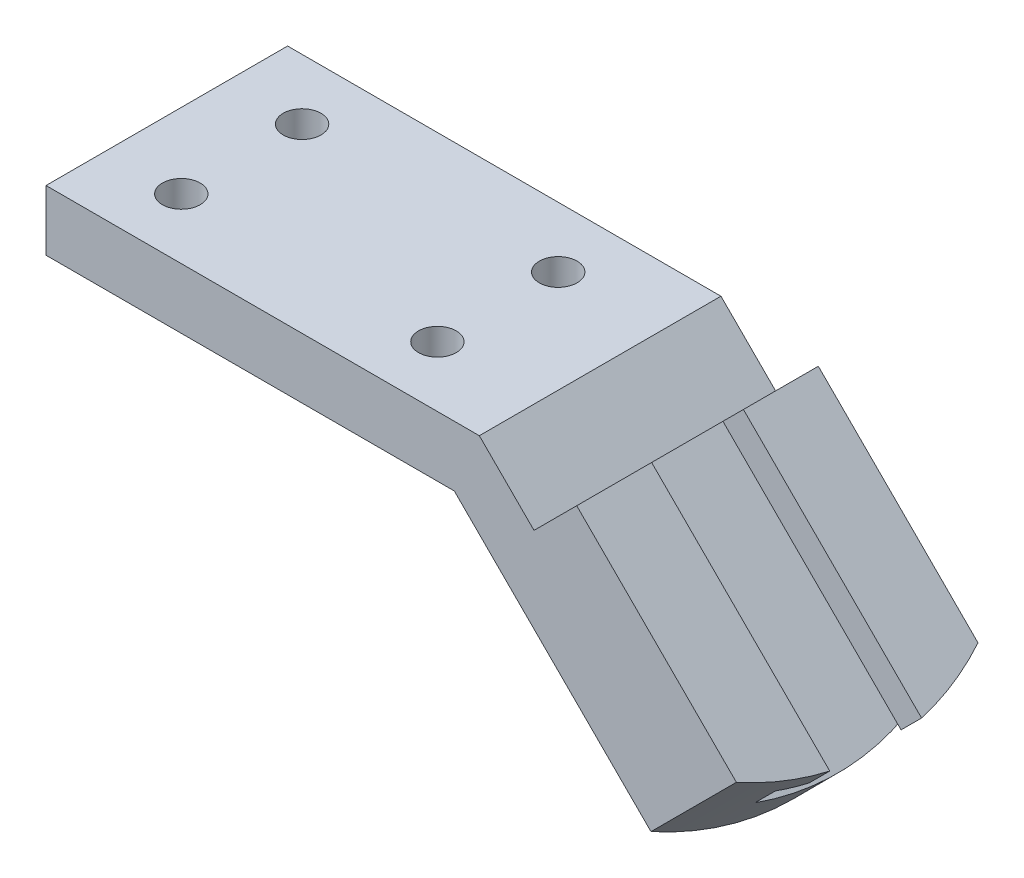
ISO-10303-21;
HEADER;
FILE_DESCRIPTION(('STEP AP214'),'2;1');
FILE_NAME('part.step','',(''),(''),'','','');
FILE_SCHEMA(('AUTOMOTIVE_DESIGN { 1 0 10303 214 1 1 1 1 }'));
ENDSEC;
DATA;
#1=APPLICATION_CONTEXT('core data for automotive mechanical design processes');
#2=APPLICATION_PROTOCOL_DEFINITION('international standard','automotive_design',2000,#1);
#3=PRODUCT_CONTEXT('',#1,'mechanical');
#4=PRODUCT('Part','Part','',(#3));
#5=PRODUCT_RELATED_PRODUCT_CATEGORY('part','',(#4));
#6=PRODUCT_DEFINITION_FORMATION('','',#4);
#7=PRODUCT_DEFINITION_CONTEXT('part definition',#1,'design');
#8=PRODUCT_DEFINITION('design','',#6,#7);
#9=PRODUCT_DEFINITION_SHAPE('','',#8);
#10=(LENGTH_UNIT() NAMED_UNIT(*) SI_UNIT(.MILLI.,.METRE.));
#11=(NAMED_UNIT(*) PLANE_ANGLE_UNIT() SI_UNIT($,.RADIAN.));
#12=(NAMED_UNIT(*) SI_UNIT($,.STERADIAN.) SOLID_ANGLE_UNIT());
#13=UNCERTAINTY_MEASURE_WITH_UNIT(LENGTH_MEASURE(1.E-05),#10,'distance_accuracy_value','');
#14=(GEOMETRIC_REPRESENTATION_CONTEXT(3) GLOBAL_UNCERTAINTY_ASSIGNED_CONTEXT((#13)) GLOBAL_UNIT_ASSIGNED_CONTEXT((#10,
#11,#12)) REPRESENTATION_CONTEXT('',''));
#15=CARTESIAN_POINT('',(0.,0.,0.));
#16=DIRECTION('',(0.,0.,1.));
#17=DIRECTION('',(1.,0.,0.));
#18=AXIS2_PLACEMENT_3D('',#15,#16,#17);
#19=CARTESIAN_POINT('',(85.852,0.,25.4));
#20=DIRECTION('',(0.707106781186543,0.707106781186552,0.));
#21=DIRECTION('',(-0.707106781186552,0.707106781186543,0.));
#22=AXIS2_PLACEMENT_3D('',#19,#20,#21);
#23=PLANE('',#22);
#24=DIRECTION('',(0.707106781186552,-0.707106781186543,0.));
#25=VECTOR('',#24,1.);
#26=CARTESIAN_POINT('',(85.852,0.,-25.4));
#27=LINE('',#26,#25);
#28=CARTESIAN_POINT('',(85.852,0.,-25.4));
#29=VERTEX_POINT('',#28);
#30=CARTESIAN_POINT('',(127.201134012294,-41.3491340122936,-25.4));
#31=VERTEX_POINT('',#30);
#32=EDGE_CURVE('E149',#29,#31,#27,.T.);
#33=ORIENTED_EDGE('',*,*,#32,.T.);
#34=CARTESIAN_POINT('',(93.6269839560378,-7.77498395603773,0.));
#35=DIRECTION('',(0.707106781186543,0.707106781186552,0.));
#36=DIRECTION('',(-0.707106781186552,0.707106781186543,0.));
#37=AXIS2_PLACEMENT_3D('',#34,#35,#36);
#38=CIRCLE('',#37,53.8479999999999);
#39=CARTESIAN_POINT('',(127.201134012294,-41.3491340122936,25.4));
#40=VERTEX_POINT('',#39);
#41=EDGE_CURVE('E215',#31,#40,#38,.F.);
#42=ORIENTED_EDGE('',*,*,#41,.T.);
#43=DIRECTION('',(0.707106781186552,-0.707106781186543,0.));
#44=VECTOR('',#43,1.);
#45=CARTESIAN_POINT('',(85.852,0.,25.4));
#46=LINE('',#45,#44);
#47=CARTESIAN_POINT('',(85.852,0.,25.4));
#48=VERTEX_POINT('',#47);
#49=EDGE_CURVE('E249',#48,#40,#46,.T.);
#50=ORIENTED_EDGE('',*,*,#49,.F.);
#51=DIRECTION('',(0.,0.,-1.));
#52=VECTOR('',#51,1.);
#53=CARTESIAN_POINT('',(85.852,0.,25.4));
#54=LINE('',#53,#52);
#55=EDGE_CURVE('E163',#48,#29,#54,.T.);
#56=ORIENTED_EDGE('',*,*,#55,.T.);
#57=EDGE_LOOP('',(#33,#42,#50,#56));
#58=FACE_BOUND('',#57,.T.);
#59=ADVANCED_FACE('F51',(#58),#23,.F.);
#60=CARTESIAN_POINT('',(0.,0.,-25.4));
#61=DIRECTION('',(0.,0.,1.));
#62=DIRECTION('',(1.,0.,0.));
#63=AXIS2_PLACEMENT_3D('',#60,#61,#62);
#64=PLANE('',#63);
#65=DIRECTION('',(0.707106781186544,0.707106781186551,0.));
#66=VECTOR('',#65,1.);
#67=CARTESIAN_POINT('',(136.540600378206,-32.0096676463819,-25.4));
#68=LINE('',#67,#66);
#69=CARTESIAN_POINT('',(145.161646254432,-23.3886217701554,-25.4));
#70=VERTEX_POINT('',#69);
#71=EDGE_CURVE('E147',#31,#70,#68,.T.);
#72=ORIENTED_EDGE('',*,*,#71,.F.);
#73=ORIENTED_EDGE('',*,*,#32,.F.);
#74=DIRECTION('',(1.,0.,0.));
#75=VECTOR('',#74,1.);
#76=CARTESIAN_POINT('',(0.,0.,-25.4));
#77=LINE('',#76,#75);
#78=CARTESIAN_POINT('',(0.,0.,-25.4));
#79=VERTEX_POINT('',#78);
#80=EDGE_CURVE('E146',#79,#29,#77,.T.);
#81=ORIENTED_EDGE('',*,*,#80,.F.);
#82=DIRECTION('',(0.,-1.,0.));
#83=VECTOR('',#82,1.);
#84=CARTESIAN_POINT('',(0.,12.7,-25.4));
#85=LINE('',#84,#83);
#86=CARTESIAN_POINT('',(0.,12.7,-25.4));
#87=VERTEX_POINT('',#86);
#88=EDGE_CURVE('E143',#87,#79,#85,.T.);
#89=ORIENTED_EDGE('',*,*,#88,.F.);
#90=DIRECTION('',(-1.,0.,0.));
#91=VECTOR('',#90,1.);
#92=CARTESIAN_POINT('',(91.1125122421383,12.7,-25.4));
#93=LINE('',#92,#91);
#94=CARTESIAN_POINT('',(91.1125122421383,12.7,-25.4));
#95=VERTEX_POINT('',#94);
#96=EDGE_CURVE('E98',#95,#87,#93,.T.);
#97=ORIENTED_EDGE('',*,*,#96,.F.);
#98=DIRECTION('',(-0.707106781186534,0.707106781186561,0.));
#99=VECTOR('',#98,1.);
#100=CARTESIAN_POINT('',(102.607240077107,1.20527216503115,-25.4));
#101=LINE('',#100,#99);
#102=CARTESIAN_POINT('',(102.607240077107,1.20527216503115,-25.4));
#103=VERTEX_POINT('',#102);
#104=EDGE_CURVE('E92',#103,#95,#101,.T.);
#105=ORIENTED_EDGE('',*,*,#104,.F.);
#106=DIRECTION('',(-0.70710678118654,-0.707106781186555,0.));
#107=VECTOR('',#106,1.);
#108=CARTESIAN_POINT('',(111.587496198176,10.1855282861004,-25.4));
#109=LINE('',#108,#107);
#110=CARTESIAN_POINT('',(111.587496198176,10.1855282861004,-25.4));
#111=VERTEX_POINT('',#110);
#112=EDGE_CURVE('E133',#111,#103,#109,.T.);
#113=ORIENTED_EDGE('',*,*,#112,.F.);
#114=DIRECTION('',(-0.707106781186551,0.707106781186544,0.));
#115=VECTOR('',#114,1.);
#116=CARTESIAN_POINT('',(149.663782151509,-27.8907576672326,-25.4));
#117=LINE('',#116,#115);
#118=EDGE_CURVE('E152',#70,#111,#117,.T.);
#119=ORIENTED_EDGE('',*,*,#118,.F.);
#120=EDGE_LOOP('',(#72,#73,#81,#89,#97,#105,#113,#119));
#121=FACE_BOUND('',#120,.T.);
#122=ADVANCED_FACE('F269',(#121),#64,.F.);
#123=CARTESIAN_POINT('',(52.2654663659112,52.2654663659117,0.));
#124=DIRECTION('',(0.707106781186544,0.707106781186551,0.));
#125=DIRECTION('',(-0.707106781186551,0.707106781186544,0.));
#126=AXIS2_PLACEMENT_3D('',#123,#124,#125);
#127=PLANE('',#126);
#128=CARTESIAN_POINT('',(102.966450321949,1.564482409874,0.));
#129=DIRECTION('',(0.707106781186544,0.707106781186551,0.));
#130=DIRECTION('',(-0.707106781186551,0.707106781186544,0.));
#131=AXIS2_PLACEMENT_3D('',#128,#129,#130);
#132=CIRCLE('',#131,53.8479999999999);
#133=CARTESIAN_POINT('',(139.378039136502,-34.8471064046775,-15.748));
#134=VERTEX_POINT('',#133);
#135=CARTESIAN_POINT('',(139.378039136502,-34.8471064046775,15.748));
#136=VERTEX_POINT('',#135);
#137=EDGE_CURVE('E168',#134,#136,#132,.F.);
#138=ORIENTED_EDGE('',*,*,#137,.F.);
#139=DIRECTION('',(-0.707106781186555,0.70710678118654,0.));
#140=VECTOR('',#139,1.);
#141=CARTESIAN_POINT('',(149.714658548451,-45.1837258166269,-15.748));
#142=LINE('',#141,#140);
#143=CARTESIAN_POINT('',(102.966450321949,1.56448240987394,-15.748));
#144=VERTEX_POINT('',#143);
#145=EDGE_CURVE('E200',#134,#144,#142,.T.);
#146=ORIENTED_EDGE('',*,*,#145,.T.);
#147=DIRECTION('',(0.,0.,1.));
#148=VECTOR('',#147,1.);
#149=CARTESIAN_POINT('',(102.966450321949,1.56448240987398,0.));
#150=LINE('',#149,#148);
#151=CARTESIAN_POINT('',(102.966450321949,1.56448240987394,15.748));
#152=VERTEX_POINT('',#151);
#153=EDGE_CURVE('E199',#144,#152,#150,.T.);
#154=ORIENTED_EDGE('',*,*,#153,.T.);
#155=DIRECTION('',(-0.707106781186555,0.70710678118654,0.));
#156=VECTOR('',#155,1.);
#157=CARTESIAN_POINT('',(149.714658548451,-45.1837258166269,15.748));
#158=LINE('',#157,#156);
#159=EDGE_CURVE('E183',#136,#152,#158,.T.);
#160=ORIENTED_EDGE('',*,*,#159,.F.);
#161=EDGE_LOOP('',(#138,#146,#154,#160));
#162=FACE_BOUND('',#161,.T.);
#163=ADVANCED_FACE('F195',(#162),#127,.T.);
#164=CARTESIAN_POINT('',(149.663782151509,-27.8907576672326,25.4));
#165=DIRECTION('',(-0.707106781186544,-0.707106781186551,0.));
#166=DIRECTION('',(0.707106781186551,-0.707106781186544,0.));
#167=AXIS2_PLACEMENT_3D('',#164,#165,#166);
#168=PLANE('',#167);
#169=CARTESIAN_POINT('',(111.587496198176,10.1855282861004,0.));
#170=DIRECTION('',(0.707106781186544,0.707106781186551,0.));
#171=DIRECTION('',(-0.707106781186551,0.707106781186544,0.));
#172=AXIS2_PLACEMENT_3D('',#169,#170,#171);
#173=CIRCLE('',#172,53.8479999999999);
#174=CARTESIAN_POINT('',(145.161646254432,-23.3886217701555,25.4));
#175=VERTEX_POINT('',#174);
#176=CARTESIAN_POINT('',(149.047114455708,-27.274089971431,9.65199999999999));
#177=VERTEX_POINT('',#176);
#178=EDGE_CURVE('E221',#175,#177,#173,.T.);
#179=ORIENTED_EDGE('',*,*,#178,.T.);
#180=DIRECTION('',(0.707106781186551,-0.707106781186544,0.));
#181=VECTOR('',#180,1.);
#182=CARTESIAN_POINT('',(60.8865122421375,60.8865122421382,9.65200000000001));
#183=LINE('',#182,#181);
#184=CARTESIAN_POINT('',(111.587496198176,10.1855282861004,9.652));
#185=VERTEX_POINT('',#184);
#186=EDGE_CURVE('E227',#185,#177,#183,.T.);
#187=ORIENTED_EDGE('',*,*,#186,.F.);
#188=DIRECTION('',(0.,0.,-1.));
#189=VECTOR('',#188,1.);
#190=CARTESIAN_POINT('',(111.587496198176,10.1855282861004,25.4));
#191=LINE('',#190,#189);
#192=CARTESIAN_POINT('',(111.587496198176,10.1855282861004,25.4));
#193=VERTEX_POINT('',#192);
#194=EDGE_CURVE('E161',#193,#185,#191,.T.);
#195=ORIENTED_EDGE('',*,*,#194,.F.);
#196=DIRECTION('',(-0.707106781186551,0.707106781186544,0.));
#197=VECTOR('',#196,1.);
#198=CARTESIAN_POINT('',(149.663782151509,-27.8907576672326,25.4));
#199=LINE('',#198,#197);
#200=EDGE_CURVE('E124',#175,#193,#199,.T.);
#201=ORIENTED_EDGE('',*,*,#200,.F.);
#202=EDGE_LOOP('',(#179,#187,#195,#201));
#203=FACE_BOUND('',#202,.T.);
#204=ADVANCED_FACE('F288',(#203),#168,.F.);
#205=CARTESIAN_POINT('',(111.587496198176,10.1855282861004,0.));
#206=DIRECTION('',(0.707106781186544,0.707106781186551,0.));
#207=DIRECTION('',(-0.707106781186551,0.707106781186544,0.));
#208=AXIS2_PLACEMENT_3D('',#205,#206,#207);
#209=CIRCLE('',#208,53.8479999999999);
#210=CARTESIAN_POINT('',(149.047114455708,-27.274089971431,-9.65200000000002));
#211=VERTEX_POINT('',#210);
#212=EDGE_CURVE('E218',#211,#70,#209,.T.);
#213=ORIENTED_EDGE('',*,*,#212,.T.);
#214=ORIENTED_EDGE('',*,*,#118,.T.);
#215=CARTESIAN_POINT('',(111.587496198176,10.1855282861004,-9.652));
#216=VERTEX_POINT('',#215);
#217=EDGE_CURVE('E134',#216,#111,#191,.T.);
#218=ORIENTED_EDGE('',*,*,#217,.F.);
#219=DIRECTION('',(0.707106781186551,-0.707106781186544,0.));
#220=VECTOR('',#219,1.);
#221=CARTESIAN_POINT('',(60.8865122421375,60.8865122421382,-9.65199999999997));
#222=LINE('',#221,#220);
#223=EDGE_CURVE('E224',#216,#211,#222,.T.);
#224=ORIENTED_EDGE('',*,*,#223,.T.);
#225=EDGE_LOOP('',(#213,#214,#218,#224));
#226=FACE_BOUND('',#225,.T.);
#227=ADVANCED_FACE('F272',(#226),#168,.F.);
#228=CARTESIAN_POINT('',(0.,0.,25.4));
#229=DIRECTION('',(0.,0.,1.));
#230=DIRECTION('',(1.,0.,0.));
#231=AXIS2_PLACEMENT_3D('',#228,#229,#230);
#232=PLANE('',#231);
#233=ORIENTED_EDGE('',*,*,#49,.T.);
#234=DIRECTION('',(0.707106781186544,0.707106781186551,0.));
#235=VECTOR('',#234,1.);
#236=CARTESIAN_POINT('',(136.540600378206,-32.0096676463819,25.4));
#237=LINE('',#236,#235);
#238=EDGE_CURVE('E234',#40,#175,#237,.T.);
#239=ORIENTED_EDGE('',*,*,#238,.T.);
#240=ORIENTED_EDGE('',*,*,#200,.T.);
#241=DIRECTION('',(-0.70710678118654,-0.707106781186555,0.));
#242=VECTOR('',#241,1.);
#243=CARTESIAN_POINT('',(111.587496198176,10.1855282861004,25.4));
#244=LINE('',#243,#242);
#245=CARTESIAN_POINT('',(102.607240077107,1.20527216503115,25.4));
#246=VERTEX_POINT('',#245);
#247=EDGE_CURVE('E116',#193,#246,#244,.T.);
#248=ORIENTED_EDGE('',*,*,#247,.T.);
#249=DIRECTION('',(-0.707106781186534,0.707106781186561,0.));
#250=VECTOR('',#249,1.);
#251=CARTESIAN_POINT('',(102.607240077107,1.20527216503115,25.4));
#252=LINE('',#251,#250);
#253=CARTESIAN_POINT('',(91.1125122421383,12.7,25.4));
#254=VERTEX_POINT('',#253);
#255=EDGE_CURVE('E121',#246,#254,#252,.T.);
#256=ORIENTED_EDGE('',*,*,#255,.T.);
#257=DIRECTION('',(-1.,0.,0.));
#258=VECTOR('',#257,1.);
#259=CARTESIAN_POINT('',(91.1125122421383,12.7,25.4));
#260=LINE('',#259,#258);
#261=CARTESIAN_POINT('',(0.,12.7,25.4));
#262=VERTEX_POINT('',#261);
#263=EDGE_CURVE('E68',#254,#262,#260,.T.);
#264=ORIENTED_EDGE('',*,*,#263,.T.);
#265=DIRECTION('',(0.,-1.,0.));
#266=VECTOR('',#265,1.);
#267=CARTESIAN_POINT('',(0.,12.7,25.4));
#268=LINE('',#267,#266);
#269=CARTESIAN_POINT('',(0.,0.,25.4));
#270=VERTEX_POINT('',#269);
#271=EDGE_CURVE('E158',#262,#270,#268,.T.);
#272=ORIENTED_EDGE('',*,*,#271,.T.);
#273=DIRECTION('',(1.,0.,0.));
#274=VECTOR('',#273,1.);
#275=CARTESIAN_POINT('',(0.,0.,25.4));
#276=LINE('',#275,#274);
#277=EDGE_CURVE('E107',#270,#48,#276,.T.);
#278=ORIENTED_EDGE('',*,*,#277,.T.);
#279=EDGE_LOOP('',(#233,#239,#240,#248,#256,#264,#272,#278));
#280=FACE_BOUND('',#279,.T.);
#281=ADVANCED_FACE('F119',(#280),#232,.T.);
#282=CARTESIAN_POINT('',(0.,12.7,25.4));
#283=DIRECTION('',(1.,0.,0.));
#284=DIRECTION('',(0.,0.,-1.));
#285=AXIS2_PLACEMENT_3D('',#282,#283,#284);
#286=PLANE('',#285);
#287=ORIENTED_EDGE('',*,*,#88,.T.);
#288=DIRECTION('',(0.,0.,-1.));
#289=VECTOR('',#288,1.);
#290=CARTESIAN_POINT('',(0.,0.,25.4));
#291=LINE('',#290,#289);
#292=EDGE_CURVE('E166',#270,#79,#291,.T.);
#293=ORIENTED_EDGE('',*,*,#292,.F.);
#294=ORIENTED_EDGE('',*,*,#271,.F.);
#295=DIRECTION('',(0.,0.,-1.));
#296=VECTOR('',#295,1.);
#297=CARTESIAN_POINT('',(0.,12.7,25.4));
#298=LINE('',#297,#296);
#299=EDGE_CURVE('E139',#262,#87,#298,.T.);
#300=ORIENTED_EDGE('',*,*,#299,.T.);
#301=EDGE_LOOP('',(#287,#293,#294,#300));
#302=FACE_BOUND('',#301,.T.);
#303=ADVANCED_FACE('F53',(#302),#286,.F.);
#304=CARTESIAN_POINT('',(0.,0.,25.4));
#305=DIRECTION('',(0.,1.,0.));
#306=DIRECTION('',(0.,0.,1.));
#307=AXIS2_PLACEMENT_3D('',#304,#305,#306);
#308=PLANE('',#307);
#309=CARTESIAN_POINT('',(69.596,0.,12.7));
#310=DIRECTION('',(0.,1.,0.));
#311=DIRECTION('',(0.,0.,1.));
#312=AXIS2_PLACEMENT_3D('',#309,#310,#311);
#313=CIRCLE('',#312,3.96874999999999);
#314=CARTESIAN_POINT('',(69.596,0.,16.66875));
#315=VERTEX_POINT('',#314);
#316=EDGE_CURVE('E366',#315,#315,#313,.T.);
#317=ORIENTED_EDGE('',*,*,#316,.T.);
#318=EDGE_LOOP('',(#317));
#319=FACE_BOUND('',#318,.T.);
#320=CARTESIAN_POINT('',(15.748,0.,12.7));
#321=DIRECTION('',(0.,1.,0.));
#322=DIRECTION('',(0.,0.,1.));
#323=AXIS2_PLACEMENT_3D('',#320,#321,#322);
#324=CIRCLE('',#323,3.96875);
#325=CARTESIAN_POINT('',(15.748,0.,16.66875));
#326=VERTEX_POINT('',#325);
#327=EDGE_CURVE('E370',#326,#326,#324,.T.);
#328=ORIENTED_EDGE('',*,*,#327,.T.);
#329=EDGE_LOOP('',(#328));
#330=FACE_BOUND('',#329,.T.);
#331=CARTESIAN_POINT('',(69.596,0.,-12.7));
#332=DIRECTION('',(0.,1.,0.));
#333=DIRECTION('',(0.,0.,1.));
#334=AXIS2_PLACEMENT_3D('',#331,#332,#333);
#335=CIRCLE('',#334,3.96874999999999);
#336=CARTESIAN_POINT('',(69.596,0.,-8.73125000000001));
#337=VERTEX_POINT('',#336);
#338=EDGE_CURVE('E374',#337,#337,#335,.T.);
#339=ORIENTED_EDGE('',*,*,#338,.T.);
#340=EDGE_LOOP('',(#339));
#341=FACE_BOUND('',#340,.T.);
#342=CARTESIAN_POINT('',(15.748,0.,-12.7));
#343=DIRECTION('',(0.,1.,0.));
#344=DIRECTION('',(0.,0.,1.));
#345=AXIS2_PLACEMENT_3D('',#342,#343,#344);
#346=CIRCLE('',#345,3.96875);
#347=CARTESIAN_POINT('',(15.748,0.,-8.73125));
#348=VERTEX_POINT('',#347);
#349=EDGE_CURVE('E325',#348,#348,#346,.T.);
#350=ORIENTED_EDGE('',*,*,#349,.T.);
#351=EDGE_LOOP('',(#350));
#352=FACE_BOUND('',#351,.T.);
#353=ORIENTED_EDGE('',*,*,#80,.T.);
#354=ORIENTED_EDGE('',*,*,#55,.F.);
#355=ORIENTED_EDGE('',*,*,#277,.F.);
#356=ORIENTED_EDGE('',*,*,#292,.T.);
#357=EDGE_LOOP('',(#353,#354,#355,#356));
#358=FACE_BOUND('',#357,.T.);
#359=ADVANCED_FACE('F355',(#319,#330,#341,#352,#358),#308,.F.);
#360=CARTESIAN_POINT('',(111.587496198176,10.1855282861004,25.4));
#361=DIRECTION('',(0.707106781186555,-0.70710678118654,0.));
#362=DIRECTION('',(0.70710678118654,0.707106781186555,0.));
#363=AXIS2_PLACEMENT_3D('',#360,#361,#362);
#364=PLANE('',#363);
#365=DIRECTION('',(0.707106781186544,0.707106781186551,0.));
#366=VECTOR('',#365,1.);
#367=CARTESIAN_POINT('',(102.966450321949,1.56448240987398,9.652));
#368=LINE('',#367,#366);
#369=CARTESIAN_POINT('',(107.276973260063,5.87500534798718,9.652));
#370=VERTEX_POINT('',#369);
#371=EDGE_CURVE('E239',#370,#185,#368,.T.);
#372=ORIENTED_EDGE('',*,*,#371,.F.);
#373=DIRECTION('',(0.,0.,-1.));
#374=VECTOR('',#373,1.);
#375=CARTESIAN_POINT('',(107.276973260063,5.87500534798718,-15.748));
#376=LINE('',#375,#374);
#377=CARTESIAN_POINT('',(107.276973260063,5.87500534798718,15.748));
#378=VERTEX_POINT('',#377);
#379=EDGE_CURVE('E204',#378,#370,#376,.T.);
#380=ORIENTED_EDGE('',*,*,#379,.F.);
#381=DIRECTION('',(0.70710678118654,0.707106781186555,0.));
#382=VECTOR('',#381,1.);
#383=CARTESIAN_POINT('',(102.966450321949,1.56448240987394,15.748));
#384=LINE('',#383,#382);
#385=EDGE_CURVE('E319',#152,#378,#384,.T.);
#386=ORIENTED_EDGE('',*,*,#385,.F.);
#387=ORIENTED_EDGE('',*,*,#153,.F.);
#388=DIRECTION('',(-0.70710678118654,-0.707106781186555,0.));
#389=VECTOR('',#388,1.);
#390=CARTESIAN_POINT('',(102.966450321949,1.56448240987394,-15.748));
#391=LINE('',#390,#389);
#392=CARTESIAN_POINT('',(107.276973260063,5.87500534798718,-15.748));
#393=VERTEX_POINT('',#392);
#394=EDGE_CURVE('E318',#393,#144,#391,.T.);
#395=ORIENTED_EDGE('',*,*,#394,.F.);
#396=CARTESIAN_POINT('',(107.276973260063,5.87500534798718,-9.652));
#397=VERTEX_POINT('',#396);
#398=EDGE_CURVE('E327',#397,#393,#376,.T.);
#399=ORIENTED_EDGE('',*,*,#398,.F.);
#400=DIRECTION('',(0.707106781186544,0.707106781186551,0.));
#401=VECTOR('',#400,1.);
#402=CARTESIAN_POINT('',(102.966450321949,1.56448240987397,-9.652));
#403=LINE('',#402,#401);
#404=EDGE_CURVE('E242',#397,#216,#403,.T.);
#405=ORIENTED_EDGE('',*,*,#404,.T.);
#406=ORIENTED_EDGE('',*,*,#217,.T.);
#407=ORIENTED_EDGE('',*,*,#112,.T.);
#408=DIRECTION('',(0.,0.,-1.));
#409=VECTOR('',#408,1.);
#410=CARTESIAN_POINT('',(102.607240077107,1.20527216503115,25.4));
#411=LINE('',#410,#409);
#412=EDGE_CURVE('E129',#246,#103,#411,.T.);
#413=ORIENTED_EDGE('',*,*,#412,.F.);
#414=ORIENTED_EDGE('',*,*,#247,.F.);
#415=ORIENTED_EDGE('',*,*,#194,.T.);
#416=EDGE_LOOP('',(#372,#380,#386,#387,#395,#399,#405,#406,#407,#413,#414,#415));
#417=FACE_BOUND('',#416,.T.);
#418=ADVANCED_FACE('F131',(#417),#364,.F.);
#419=CARTESIAN_POINT('',(102.607240077107,1.20527216503115,25.4));
#420=DIRECTION('',(-0.707106781186561,-0.707106781186534,0.));
#421=DIRECTION('',(0.707106781186534,-0.707106781186561,0.));
#422=AXIS2_PLACEMENT_3D('',#419,#420,#421);
#423=PLANE('',#422);
#424=ORIENTED_EDGE('',*,*,#104,.T.);
#425=DIRECTION('',(0.,0.,-1.));
#426=VECTOR('',#425,1.);
#427=CARTESIAN_POINT('',(91.1125122421383,12.7,25.4));
#428=LINE('',#427,#426);
#429=EDGE_CURVE('E135',#254,#95,#428,.T.);
#430=ORIENTED_EDGE('',*,*,#429,.F.);
#431=ORIENTED_EDGE('',*,*,#255,.F.);
#432=ORIENTED_EDGE('',*,*,#412,.T.);
#433=EDGE_LOOP('',(#424,#430,#431,#432));
#434=FACE_BOUND('',#433,.T.);
#435=ADVANCED_FACE('F137',(#434),#423,.F.);
#436=CARTESIAN_POINT('',(91.1125122421383,12.7,25.4));
#437=DIRECTION('',(0.,-1.,0.));
#438=DIRECTION('',(1.,0.,0.));
#439=AXIS2_PLACEMENT_3D('',#436,#437,#438);
#440=PLANE('',#439);
#441=CARTESIAN_POINT('',(69.596,12.7,12.7));
#442=DIRECTION('',(0.,1.,0.));
#443=DIRECTION('',(-1.,0.,0.));
#444=AXIS2_PLACEMENT_3D('',#441,#442,#443);
#445=CIRCLE('',#444,3.96874999999999);
#446=CARTESIAN_POINT('',(65.62725,12.7,12.7));
#447=VERTEX_POINT('',#446);
#448=EDGE_CURVE('E428',#447,#447,#445,.T.);
#449=ORIENTED_EDGE('',*,*,#448,.F.);
#450=EDGE_LOOP('',(#449));
#451=FACE_BOUND('',#450,.T.);
#452=CARTESIAN_POINT('',(15.748,12.7,12.7));
#453=DIRECTION('',(0.,1.,0.));
#454=DIRECTION('',(-1.,0.,0.));
#455=AXIS2_PLACEMENT_3D('',#452,#453,#454);
#456=CIRCLE('',#455,3.96875);
#457=CARTESIAN_POINT('',(11.77925,12.7,12.7));
#458=VERTEX_POINT('',#457);
#459=EDGE_CURVE('E429',#458,#458,#456,.T.);
#460=ORIENTED_EDGE('',*,*,#459,.F.);
#461=EDGE_LOOP('',(#460));
#462=FACE_BOUND('',#461,.T.);
#463=CARTESIAN_POINT('',(69.596,12.7,-12.7));
#464=DIRECTION('',(0.,1.,0.));
#465=DIRECTION('',(-1.,0.,0.));
#466=AXIS2_PLACEMENT_3D('',#463,#464,#465);
#467=CIRCLE('',#466,3.96874999999999);
#468=CARTESIAN_POINT('',(65.62725,12.7,-12.7));
#469=VERTEX_POINT('',#468);
#470=EDGE_CURVE('E436',#469,#469,#467,.T.);
#471=ORIENTED_EDGE('',*,*,#470,.F.);
#472=EDGE_LOOP('',(#471));
#473=FACE_BOUND('',#472,.T.);
#474=CARTESIAN_POINT('',(15.748,12.7,-12.7));
#475=DIRECTION('',(0.,1.,0.));
#476=DIRECTION('',(-1.,0.,0.));
#477=AXIS2_PLACEMENT_3D('',#474,#475,#476);
#478=CIRCLE('',#477,3.96875);
#479=CARTESIAN_POINT('',(11.77925,12.7,-12.7));
#480=VERTEX_POINT('',#479);
#481=EDGE_CURVE('E330',#480,#480,#478,.T.);
#482=ORIENTED_EDGE('',*,*,#481,.F.);
#483=EDGE_LOOP('',(#482));
#484=FACE_BOUND('',#483,.T.);
#485=ORIENTED_EDGE('',*,*,#96,.T.);
#486=ORIENTED_EDGE('',*,*,#299,.F.);
#487=ORIENTED_EDGE('',*,*,#263,.F.);
#488=ORIENTED_EDGE('',*,*,#429,.T.);
#489=EDGE_LOOP('',(#485,#486,#487,#488));
#490=FACE_BOUND('',#489,.T.);
#491=ADVANCED_FACE('F379',(#451,#462,#473,#484,#490),#440,.F.);
#492=CARTESIAN_POINT('',(102.966450321949,1.56448240987399,0.));
#493=DIRECTION('',(0.707106781186544,0.707106781186551,0.));
#494=DIRECTION('',(-0.707106781186551,0.707106781186544,0.));
#495=AXIS2_PLACEMENT_3D('',#492,#493,#494);
#496=CYLINDRICAL_SURFACE('',#495,53.8479999999999);
#497=CARTESIAN_POINT('',(107.276973260063,5.87500534798722,0.));
#498=DIRECTION('',(0.70710678118654,0.707106781186555,0.));
#499=DIRECTION('',(-0.707106781186555,0.70710678118654,0.));
#500=AXIS2_PLACEMENT_3D('',#497,#498,#499);
#501=CIRCLE('',#500,53.8479999999999);
#502=CARTESIAN_POINT('',(143.688562074615,-30.5365834665642,-15.748));
#503=VERTEX_POINT('',#502);
#504=CARTESIAN_POINT('',(144.736591517595,-31.584612909544,-9.65200000000002));
#505=VERTEX_POINT('',#504);
#506=EDGE_CURVE('E208',#503,#505,#501,.F.);
#507=ORIENTED_EDGE('',*,*,#506,.F.);
#508=DIRECTION('',(0.707106781186544,0.707106781186551,0.));
#509=VECTOR('',#508,1.);
#510=CARTESIAN_POINT('',(139.378039136501,-34.8471064046777,-15.748));
#511=LINE('',#510,#509);
#512=EDGE_CURVE('E12',#134,#503,#511,.T.);
#513=ORIENTED_EDGE('',*,*,#512,.F.);
#514=ORIENTED_EDGE('',*,*,#137,.T.);
#515=DIRECTION('',(0.707106781186544,0.707106781186551,0.));
#516=VECTOR('',#515,1.);
#517=CARTESIAN_POINT('',(139.378039136501,-34.8471064046777,15.748));
#518=LINE('',#517,#516);
#519=CARTESIAN_POINT('',(143.688562074615,-30.5365834665642,15.748));
#520=VERTEX_POINT('',#519);
#521=EDGE_CURVE('E60',#520,#136,#518,.F.);
#522=ORIENTED_EDGE('',*,*,#521,.F.);
#523=CARTESIAN_POINT('',(144.736591517595,-31.584612909544,9.65199999999999));
#524=VERTEX_POINT('',#523);
#525=EDGE_CURVE('E212',#524,#520,#501,.F.);
#526=ORIENTED_EDGE('',*,*,#525,.F.);
#527=DIRECTION('',(0.707106781186544,0.707106781186551,0.));
#528=VECTOR('',#527,1.);
#529=CARTESIAN_POINT('',(140.426068579481,-35.8951358476574,9.65199999999999));
#530=LINE('',#529,#528);
#531=EDGE_CURVE('E236',#524,#177,#530,.T.);
#532=ORIENTED_EDGE('',*,*,#531,.T.);
#533=ORIENTED_EDGE('',*,*,#178,.F.);
#534=ORIENTED_EDGE('',*,*,#238,.F.);
#535=ORIENTED_EDGE('',*,*,#41,.F.);
#536=ORIENTED_EDGE('',*,*,#71,.T.);
#537=ORIENTED_EDGE('',*,*,#212,.F.);
#538=DIRECTION('',(0.707106781186544,0.707106781186551,0.));
#539=VECTOR('',#538,1.);
#540=CARTESIAN_POINT('',(140.426068579481,-35.8951358476574,-9.65200000000002));
#541=LINE('',#540,#539);
#542=EDGE_CURVE('E220',#505,#211,#541,.T.);
#543=ORIENTED_EDGE('',*,*,#542,.F.);
#544=EDGE_LOOP('',(#507,#513,#514,#522,#526,#532,#533,#534,#535,#536,#537,#543));
#545=FACE_BOUND('',#544,.T.);
#546=ADVANCED_FACE('F262',(#545),#496,.T.);
#547=CARTESIAN_POINT('',(52.2654663659112,52.2654663659117,9.65200000000001));
#548=DIRECTION('',(0.,0.,1.));
#549=DIRECTION('',(1.,0.,0.));
#550=AXIS2_PLACEMENT_3D('',#547,#548,#549);
#551=PLANE('',#550);
#552=ORIENTED_EDGE('',*,*,#531,.F.);
#553=DIRECTION('',(-0.707106781186555,0.70710678118654,0.));
#554=VECTOR('',#553,1.);
#555=CARTESIAN_POINT('',(56.5759893040241,56.5759893040247,9.65200000000001));
#556=LINE('',#555,#554);
#557=EDGE_CURVE('E211',#524,#370,#556,.T.);
#558=ORIENTED_EDGE('',*,*,#557,.T.);
#559=ORIENTED_EDGE('',*,*,#371,.T.);
#560=ORIENTED_EDGE('',*,*,#186,.T.);
#561=EDGE_LOOP('',(#552,#558,#559,#560));
#562=FACE_BOUND('',#561,.T.);
#563=ADVANCED_FACE('F297',(#562),#551,.F.);
#564=CARTESIAN_POINT('',(52.2654663659112,52.2654663659117,-9.65199999999997));
#565=DIRECTION('',(0.,0.,1.));
#566=DIRECTION('',(1.,0.,0.));
#567=AXIS2_PLACEMENT_3D('',#564,#565,#566);
#568=PLANE('',#567);
#569=DIRECTION('',(-0.707106781186555,0.70710678118654,0.));
#570=VECTOR('',#569,1.);
#571=CARTESIAN_POINT('',(56.5759893040241,56.5759893040247,-9.65199999999997));
#572=LINE('',#571,#570);
#573=EDGE_CURVE('E171',#505,#397,#572,.T.);
#574=ORIENTED_EDGE('',*,*,#573,.F.);
#575=ORIENTED_EDGE('',*,*,#542,.T.);
#576=ORIENTED_EDGE('',*,*,#223,.F.);
#577=ORIENTED_EDGE('',*,*,#404,.F.);
#578=EDGE_LOOP('',(#574,#575,#576,#577));
#579=FACE_BOUND('',#578,.T.);
#580=ADVANCED_FACE('F337',(#579),#568,.T.);
#581=CARTESIAN_POINT('',(154.025181486564,-40.8732028785137,-15.748));
#582=DIRECTION('',(0.70710678118654,0.707106781186555,0.));
#583=DIRECTION('',(-0.707106781186555,0.70710678118654,0.));
#584=AXIS2_PLACEMENT_3D('',#581,#582,#583);
#585=PLANE('',#584);
#586=ORIENTED_EDGE('',*,*,#506,.T.);
#587=ORIENTED_EDGE('',*,*,#573,.T.);
#588=ORIENTED_EDGE('',*,*,#398,.T.);
#589=DIRECTION('',(-0.707106781186555,0.70710678118654,0.));
#590=VECTOR('',#589,1.);
#591=CARTESIAN_POINT('',(154.025181486564,-40.8732028785137,-15.748));
#592=LINE('',#591,#590);
#593=EDGE_CURVE('E202',#503,#393,#592,.T.);
#594=ORIENTED_EDGE('',*,*,#593,.F.);
#595=EDGE_LOOP('',(#586,#587,#588,#594));
#596=FACE_BOUND('',#595,.T.);
#597=ADVANCED_FACE('F335',(#596),#585,.F.);
#598=CARTESIAN_POINT('',(149.714658548451,-45.1837258166269,-15.748));
#599=DIRECTION('',(0.,0.,-1.));
#600=DIRECTION('',(-1.,0.,0.));
#601=AXIS2_PLACEMENT_3D('',#598,#599,#600);
#602=PLANE('',#601);
#603=ORIENTED_EDGE('',*,*,#512,.T.);
#604=ORIENTED_EDGE('',*,*,#593,.T.);
#605=ORIENTED_EDGE('',*,*,#394,.T.);
#606=ORIENTED_EDGE('',*,*,#145,.F.);
#607=EDGE_LOOP('',(#603,#604,#605,#606));
#608=FACE_BOUND('',#607,.T.);
#609=ADVANCED_FACE('F322',(#608),#602,.F.);
#610=ORIENTED_EDGE('',*,*,#525,.T.);
#611=DIRECTION('',(-0.707106781186555,0.70710678118654,0.));
#612=VECTOR('',#611,1.);
#613=CARTESIAN_POINT('',(154.025181486564,-40.8732028785137,15.748));
#614=LINE('',#613,#612);
#615=EDGE_CURVE('E187',#520,#378,#614,.T.);
#616=ORIENTED_EDGE('',*,*,#615,.T.);
#617=ORIENTED_EDGE('',*,*,#379,.T.);
#618=ORIENTED_EDGE('',*,*,#557,.F.);
#619=EDGE_LOOP('',(#610,#616,#617,#618));
#620=FACE_BOUND('',#619,.T.);
#621=ADVANCED_FACE('F301',(#620),#585,.F.);
#622=CARTESIAN_POINT('',(149.714658548451,-45.1837258166269,15.748));
#623=DIRECTION('',(0.,0.,1.));
#624=DIRECTION('',(0.,-1.,0.));
#625=AXIS2_PLACEMENT_3D('',#622,#623,#624);
#626=PLANE('',#625);
#627=ORIENTED_EDGE('',*,*,#521,.T.);
#628=ORIENTED_EDGE('',*,*,#159,.T.);
#629=ORIENTED_EDGE('',*,*,#385,.T.);
#630=ORIENTED_EDGE('',*,*,#615,.F.);
#631=EDGE_LOOP('',(#627,#628,#629,#630));
#632=FACE_BOUND('',#631,.T.);
#633=ADVANCED_FACE('F180',(#632),#626,.F.);
#634=CARTESIAN_POINT('',(15.748,-45.8512699093707,-12.7));
#635=DIRECTION('',(0.,1.,0.));
#636=DIRECTION('',(-1.,0.,0.));
#637=AXIS2_PLACEMENT_3D('',#634,#635,#636);
#638=CYLINDRICAL_SURFACE('',#637,3.96875);
#639=ORIENTED_EDGE('',*,*,#481,.T.);
#640=EDGE_LOOP('',(#639));
#641=FACE_BOUND('',#640,.T.);
#642=ORIENTED_EDGE('',*,*,#349,.F.);
#643=EDGE_LOOP('',(#642));
#644=FACE_BOUND('',#643,.T.);
#645=ADVANCED_FACE('F408',(#641,#644),#638,.F.);
#646=CARTESIAN_POINT('',(69.596,-45.8512699093707,-12.7));
#647=DIRECTION('',(0.,1.,0.));
#648=DIRECTION('',(-1.,0.,0.));
#649=AXIS2_PLACEMENT_3D('',#646,#647,#648);
#650=CYLINDRICAL_SURFACE('',#649,3.96874999999999);
#651=ORIENTED_EDGE('',*,*,#470,.T.);
#652=EDGE_LOOP('',(#651));
#653=FACE_BOUND('',#652,.T.);
#654=ORIENTED_EDGE('',*,*,#338,.F.);
#655=EDGE_LOOP('',(#654));
#656=FACE_BOUND('',#655,.T.);
#657=ADVANCED_FACE('F412',(#653,#656),#650,.F.);
#658=CARTESIAN_POINT('',(15.748,-45.8512699093707,12.7));
#659=DIRECTION('',(0.,1.,0.));
#660=DIRECTION('',(-1.,0.,0.));
#661=AXIS2_PLACEMENT_3D('',#658,#659,#660);
#662=CYLINDRICAL_SURFACE('',#661,3.96875);
#663=ORIENTED_EDGE('',*,*,#459,.T.);
#664=EDGE_LOOP('',(#663));
#665=FACE_BOUND('',#664,.T.);
#666=ORIENTED_EDGE('',*,*,#327,.F.);
#667=EDGE_LOOP('',(#666));
#668=FACE_BOUND('',#667,.T.);
#669=ADVANCED_FACE('F416',(#665,#668),#662,.F.);
#670=CARTESIAN_POINT('',(69.596,-45.8512699093707,12.7));
#671=DIRECTION('',(0.,1.,0.));
#672=DIRECTION('',(-1.,0.,0.));
#673=AXIS2_PLACEMENT_3D('',#670,#671,#672);
#674=CYLINDRICAL_SURFACE('',#673,3.96874999999999);
#675=ORIENTED_EDGE('',*,*,#448,.T.);
#676=EDGE_LOOP('',(#675));
#677=FACE_BOUND('',#676,.T.);
#678=ORIENTED_EDGE('',*,*,#316,.F.);
#679=EDGE_LOOP('',(#678));
#680=FACE_BOUND('',#679,.T.);
#681=ADVANCED_FACE('F420',(#677,#680),#674,.F.);
#682=CLOSED_SHELL('',(#59,#122,#163,#204,#227,#281,#303,#359,#418,#435,#491,#546,#563,#580,#597,
#609,#621,#633,#645,#657,#669,#681));
#683=MANIFOLD_SOLID_BREP('B2',#682);
#684=ADVANCED_BREP_SHAPE_REPRESENTATION('',(#18,#683),#14);
#685=SHAPE_DEFINITION_REPRESENTATION(#9,#684);
ENDSEC;
END-ISO-10303-21;
